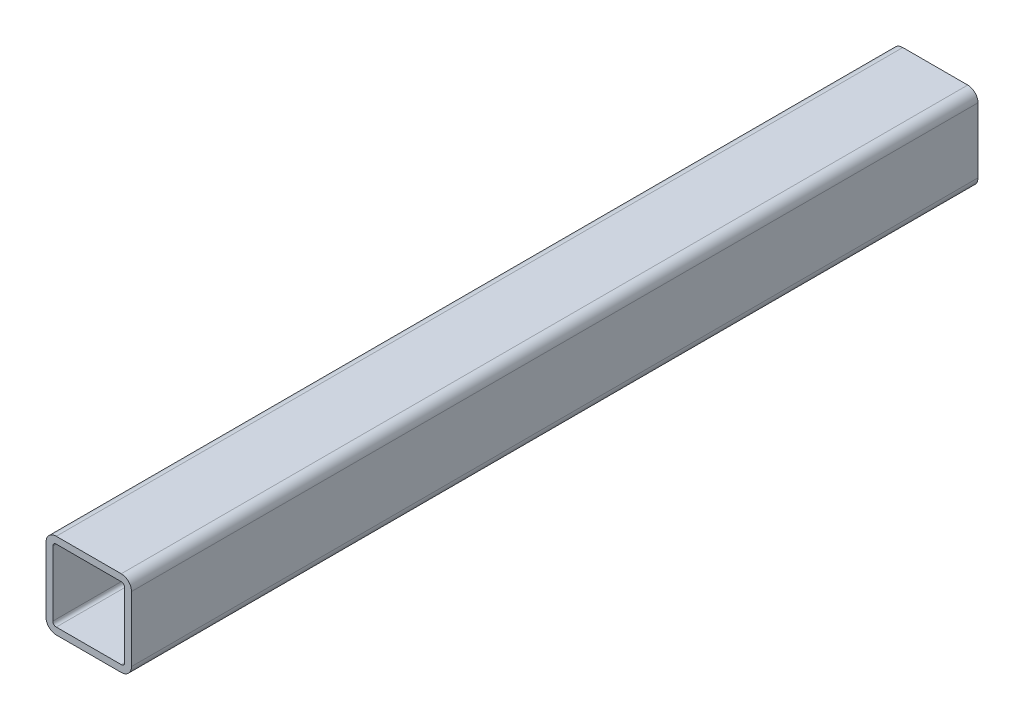
ISO-10303-21;
HEADER;
FILE_DESCRIPTION(('STEP AP214'),'2;1');
FILE_NAME('part.step','',(''),(''),'','','');
FILE_SCHEMA(('AUTOMOTIVE_DESIGN { 1 0 10303 214 1 1 1 1 }'));
ENDSEC;
DATA;
#1=APPLICATION_CONTEXT('core data for automotive mechanical design processes');
#2=APPLICATION_PROTOCOL_DEFINITION('international standard','automotive_design',2000,#1);
#3=PRODUCT_CONTEXT('',#1,'mechanical');
#4=PRODUCT('Part','Part','',(#3));
#5=PRODUCT_RELATED_PRODUCT_CATEGORY('part','',(#4));
#6=PRODUCT_DEFINITION_FORMATION('','',#4);
#7=PRODUCT_DEFINITION_CONTEXT('part definition',#1,'design');
#8=PRODUCT_DEFINITION('design','',#6,#7);
#9=PRODUCT_DEFINITION_SHAPE('','',#8);
#10=(LENGTH_UNIT() NAMED_UNIT(*) SI_UNIT(.MILLI.,.METRE.));
#11=(NAMED_UNIT(*) PLANE_ANGLE_UNIT() SI_UNIT($,.RADIAN.));
#12=(NAMED_UNIT(*) SI_UNIT($,.STERADIAN.) SOLID_ANGLE_UNIT());
#13=UNCERTAINTY_MEASURE_WITH_UNIT(LENGTH_MEASURE(1.E-05),#10,'distance_accuracy_value','');
#14=(GEOMETRIC_REPRESENTATION_CONTEXT(3) GLOBAL_UNCERTAINTY_ASSIGNED_CONTEXT((#13)) GLOBAL_UNIT_ASSIGNED_CONTEXT((#10,
#11,#12)) REPRESENTATION_CONTEXT('',''));
#15=CARTESIAN_POINT('',(0.,0.,0.));
#16=DIRECTION('',(0.,0.,1.));
#17=DIRECTION('',(1.,0.,0.));
#18=AXIS2_PLACEMENT_3D('',#15,#16,#17);
#19=CARTESIAN_POINT('',(0.,0.,247.5));
#20=DIRECTION('',(0.,0.,1.));
#21=DIRECTION('',(1.,0.,0.));
#22=AXIS2_PLACEMENT_3D('',#19,#20,#21);
#23=PLANE('',#22);
#24=DIRECTION('',(0.,1.,0.));
#25=VECTOR('',#24,1.);
#26=CARTESIAN_POINT('',(-12.5,-4.75,247.5));
#27=LINE('',#26,#25);
#28=CARTESIAN_POINT('',(-12.5,-9.5,247.5));
#29=VERTEX_POINT('',#28);
#30=CARTESIAN_POINT('',(-12.5,9.5,247.5));
#31=VERTEX_POINT('',#30);
#32=EDGE_CURVE('E215',#29,#31,#27,.T.);
#33=ORIENTED_EDGE('',*,*,#32,.F.);
#34=CARTESIAN_POINT('',(-9.5,-9.5,247.5));
#35=DIRECTION('',(0.,0.,-1.));
#36=DIRECTION('',(1.,0.,0.));
#37=AXIS2_PLACEMENT_3D('',#34,#35,#36);
#38=CIRCLE('',#37,3.);
#39=CARTESIAN_POINT('',(-9.5,-12.5,247.5));
#40=VERTEX_POINT('',#39);
#41=EDGE_CURVE('E221',#40,#29,#38,.T.);
#42=ORIENTED_EDGE('',*,*,#41,.F.);
#43=DIRECTION('',(-1.,0.,0.));
#44=VECTOR('',#43,1.);
#45=CARTESIAN_POINT('',(4.75,-12.5,247.5));
#46=LINE('',#45,#44);
#47=CARTESIAN_POINT('',(9.5,-12.5,247.5));
#48=VERTEX_POINT('',#47);
#49=EDGE_CURVE('E296',#48,#40,#46,.T.);
#50=ORIENTED_EDGE('',*,*,#49,.F.);
#51=CARTESIAN_POINT('',(9.5,-9.5,247.5));
#52=DIRECTION('',(0.,0.,-1.));
#53=DIRECTION('',(0.,1.,0.));
#54=AXIS2_PLACEMENT_3D('',#51,#52,#53);
#55=CIRCLE('',#54,3.);
#56=CARTESIAN_POINT('',(12.5,-9.5,247.5));
#57=VERTEX_POINT('',#56);
#58=EDGE_CURVE('E88',#57,#48,#55,.T.);
#59=ORIENTED_EDGE('',*,*,#58,.F.);
#60=DIRECTION('',(0.,-1.,0.));
#61=VECTOR('',#60,1.);
#62=CARTESIAN_POINT('',(12.5,4.75,247.5));
#63=LINE('',#62,#61);
#64=CARTESIAN_POINT('',(12.5,9.5,247.5));
#65=VERTEX_POINT('',#64);
#66=EDGE_CURVE('E170',#65,#57,#63,.T.);
#67=ORIENTED_EDGE('',*,*,#66,.F.);
#68=CARTESIAN_POINT('',(9.5,9.5,247.5));
#69=DIRECTION('',(0.,0.,-1.));
#70=DIRECTION('',(-1.,0.,0.));
#71=AXIS2_PLACEMENT_3D('',#68,#69,#70);
#72=CIRCLE('',#71,3.);
#73=CARTESIAN_POINT('',(9.5,12.5,247.5));
#74=VERTEX_POINT('',#73);
#75=EDGE_CURVE('E27',#74,#65,#72,.T.);
#76=ORIENTED_EDGE('',*,*,#75,.F.);
#77=DIRECTION('',(1.,0.,0.));
#78=VECTOR('',#77,1.);
#79=CARTESIAN_POINT('',(-4.75,12.5,247.5));
#80=LINE('',#79,#78);
#81=CARTESIAN_POINT('',(-9.5,12.5,247.5));
#82=VERTEX_POINT('',#81);
#83=EDGE_CURVE('E148',#82,#74,#80,.T.);
#84=ORIENTED_EDGE('',*,*,#83,.F.);
#85=CARTESIAN_POINT('',(-9.5,9.5,247.5));
#86=DIRECTION('',(0.,0.,-1.));
#87=DIRECTION('',(0.,-1.,0.));
#88=AXIS2_PLACEMENT_3D('',#85,#86,#87);
#89=CIRCLE('',#88,3.);
#90=EDGE_CURVE('E151',#31,#82,#89,.T.);
#91=ORIENTED_EDGE('',*,*,#90,.F.);
#92=EDGE_LOOP('',(#33,#42,#50,#59,#67,#76,#84,#91));
#93=FACE_BOUND('',#92,.T.);
#94=DIRECTION('',(-1.,0.,0.));
#95=VECTOR('',#94,1.);
#96=CARTESIAN_POINT('',(-4.75,10.5,247.5));
#97=LINE('',#96,#95);
#98=CARTESIAN_POINT('',(9.5,10.5,247.5));
#99=VERTEX_POINT('',#98);
#100=CARTESIAN_POINT('',(-9.5,10.5,247.5));
#101=VERTEX_POINT('',#100);
#102=EDGE_CURVE('E268',#99,#101,#97,.T.);
#103=ORIENTED_EDGE('',*,*,#102,.F.);
#104=CARTESIAN_POINT('',(9.5,9.5,247.5));
#105=DIRECTION('',(0.,0.,1.));
#106=DIRECTION('',(-1.,0.,0.));
#107=AXIS2_PLACEMENT_3D('',#104,#105,#106);
#108=CIRCLE('',#107,1.);
#109=CARTESIAN_POINT('',(10.5,9.5,247.5));
#110=VERTEX_POINT('',#109);
#111=EDGE_CURVE('E169',#110,#99,#108,.T.);
#112=ORIENTED_EDGE('',*,*,#111,.F.);
#113=DIRECTION('',(0.,1.,0.));
#114=VECTOR('',#113,1.);
#115=CARTESIAN_POINT('',(10.5,4.75,247.5));
#116=LINE('',#115,#114);
#117=CARTESIAN_POINT('',(10.5,-9.5,247.5));
#118=VERTEX_POINT('',#117);
#119=EDGE_CURVE('E250',#118,#110,#116,.T.);
#120=ORIENTED_EDGE('',*,*,#119,.F.);
#121=CARTESIAN_POINT('',(9.5,-9.5,247.5));
#122=DIRECTION('',(0.,0.,1.));
#123=DIRECTION('',(0.,1.,0.));
#124=AXIS2_PLACEMENT_3D('',#121,#122,#123);
#125=CIRCLE('',#124,1.);
#126=CARTESIAN_POINT('',(9.5,-10.5,247.5));
#127=VERTEX_POINT('',#126);
#128=EDGE_CURVE('E227',#127,#118,#125,.T.);
#129=ORIENTED_EDGE('',*,*,#128,.F.);
#130=DIRECTION('',(1.,0.,0.));
#131=VECTOR('',#130,1.);
#132=CARTESIAN_POINT('',(4.75,-10.5,247.5));
#133=LINE('',#132,#131);
#134=CARTESIAN_POINT('',(-9.5,-10.5,247.5));
#135=VERTEX_POINT('',#134);
#136=EDGE_CURVE('E281',#135,#127,#133,.T.);
#137=ORIENTED_EDGE('',*,*,#136,.F.);
#138=CARTESIAN_POINT('',(-9.5,-9.5,247.5));
#139=DIRECTION('',(0.,0.,1.));
#140=DIRECTION('',(1.,0.,0.));
#141=AXIS2_PLACEMENT_3D('',#138,#139,#140);
#142=CIRCLE('',#141,1.);
#143=CARTESIAN_POINT('',(-10.5,-9.5,247.5));
#144=VERTEX_POINT('',#143);
#145=EDGE_CURVE('E217',#144,#135,#142,.T.);
#146=ORIENTED_EDGE('',*,*,#145,.F.);
#147=DIRECTION('',(0.,-1.,0.));
#148=VECTOR('',#147,1.);
#149=CARTESIAN_POINT('',(-10.5,-4.75,247.5));
#150=LINE('',#149,#148);
#151=CARTESIAN_POINT('',(-10.5,9.5,247.5));
#152=VERTEX_POINT('',#151);
#153=EDGE_CURVE('E200',#152,#144,#150,.T.);
#154=ORIENTED_EDGE('',*,*,#153,.F.);
#155=CARTESIAN_POINT('',(-9.5,9.5,247.5));
#156=DIRECTION('',(0.,0.,1.));
#157=DIRECTION('',(0.,-1.,0.));
#158=AXIS2_PLACEMENT_3D('',#155,#156,#157);
#159=CIRCLE('',#158,1.);
#160=EDGE_CURVE('E216',#101,#152,#159,.T.);
#161=ORIENTED_EDGE('',*,*,#160,.F.);
#162=EDGE_LOOP('',(#103,#112,#120,#129,#137,#146,#154,#161));
#163=FACE_BOUND('',#162,.T.);
#164=ADVANCED_FACE('F16',(#93,#163),#23,.T.);
#165=CARTESIAN_POINT('',(0.,0.,0.));
#166=DIRECTION('',(0.,0.,1.));
#167=DIRECTION('',(1.,0.,0.));
#168=AXIS2_PLACEMENT_3D('',#165,#166,#167);
#169=PLANE('',#168);
#170=DIRECTION('',(0.,1.,0.));
#171=VECTOR('',#170,1.);
#172=CARTESIAN_POINT('',(-12.5,-4.75,0.));
#173=LINE('',#172,#171);
#174=CARTESIAN_POINT('',(-12.5,-9.5,0.));
#175=VERTEX_POINT('',#174);
#176=CARTESIAN_POINT('',(-12.5,9.5,0.));
#177=VERTEX_POINT('',#176);
#178=EDGE_CURVE('E143',#175,#177,#173,.T.);
#179=ORIENTED_EDGE('',*,*,#178,.T.);
#180=CARTESIAN_POINT('',(-9.5,9.5,0.));
#181=DIRECTION('',(0.,0.,-1.));
#182=DIRECTION('',(0.,-1.,0.));
#183=AXIS2_PLACEMENT_3D('',#180,#181,#182);
#184=CIRCLE('',#183,3.);
#185=CARTESIAN_POINT('',(-9.5,12.5,0.));
#186=VERTEX_POINT('',#185);
#187=EDGE_CURVE('E138',#177,#186,#184,.T.);
#188=ORIENTED_EDGE('',*,*,#187,.T.);
#189=DIRECTION('',(1.,0.,0.));
#190=VECTOR('',#189,1.);
#191=CARTESIAN_POINT('',(-4.75,12.5,0.));
#192=LINE('',#191,#190);
#193=CARTESIAN_POINT('',(9.5,12.5,0.));
#194=VERTEX_POINT('',#193);
#195=EDGE_CURVE('E126',#186,#194,#192,.T.);
#196=ORIENTED_EDGE('',*,*,#195,.T.);
#197=CARTESIAN_POINT('',(9.5,9.5,0.));
#198=DIRECTION('',(0.,0.,-1.));
#199=DIRECTION('',(-1.,0.,0.));
#200=AXIS2_PLACEMENT_3D('',#197,#198,#199);
#201=CIRCLE('',#200,3.);
#202=CARTESIAN_POINT('',(12.5,9.5,0.));
#203=VERTEX_POINT('',#202);
#204=EDGE_CURVE('E11',#194,#203,#201,.T.);
#205=ORIENTED_EDGE('',*,*,#204,.T.);
#206=DIRECTION('',(0.,-1.,0.));
#207=VECTOR('',#206,1.);
#208=CARTESIAN_POINT('',(12.5,4.75,0.));
#209=LINE('',#208,#207);
#210=CARTESIAN_POINT('',(12.5,-9.5,0.));
#211=VERTEX_POINT('',#210);
#212=EDGE_CURVE('E180',#203,#211,#209,.T.);
#213=ORIENTED_EDGE('',*,*,#212,.T.);
#214=CARTESIAN_POINT('',(9.5,-9.5,0.));
#215=DIRECTION('',(0.,0.,-1.));
#216=DIRECTION('',(0.,1.,0.));
#217=AXIS2_PLACEMENT_3D('',#214,#215,#216);
#218=CIRCLE('',#217,3.);
#219=CARTESIAN_POINT('',(9.5,-12.5,0.));
#220=VERTEX_POINT('',#219);
#221=EDGE_CURVE('E190',#211,#220,#218,.T.);
#222=ORIENTED_EDGE('',*,*,#221,.T.);
#223=DIRECTION('',(-1.,0.,0.));
#224=VECTOR('',#223,1.);
#225=CARTESIAN_POINT('',(4.75,-12.5,0.));
#226=LINE('',#225,#224);
#227=CARTESIAN_POINT('',(-9.5,-12.5,0.));
#228=VERTEX_POINT('',#227);
#229=EDGE_CURVE('E226',#220,#228,#226,.T.);
#230=ORIENTED_EDGE('',*,*,#229,.T.);
#231=CARTESIAN_POINT('',(-9.5,-9.5,0.));
#232=DIRECTION('',(0.,0.,-1.));
#233=DIRECTION('',(1.,0.,0.));
#234=AXIS2_PLACEMENT_3D('',#231,#232,#233);
#235=CIRCLE('',#234,3.);
#236=EDGE_CURVE('E235',#228,#175,#235,.T.);
#237=ORIENTED_EDGE('',*,*,#236,.T.);
#238=EDGE_LOOP('',(#179,#188,#196,#205,#213,#222,#230,#237));
#239=FACE_BOUND('',#238,.T.);
#240=DIRECTION('',(-1.,0.,0.));
#241=VECTOR('',#240,1.);
#242=CARTESIAN_POINT('',(-4.75,10.5,0.));
#243=LINE('',#242,#241);
#244=CARTESIAN_POINT('',(9.5,10.5,0.));
#245=VERTEX_POINT('',#244);
#246=CARTESIAN_POINT('',(-9.5,10.5,0.));
#247=VERTEX_POINT('',#246);
#248=EDGE_CURVE('E109',#245,#247,#243,.T.);
#249=ORIENTED_EDGE('',*,*,#248,.T.);
#250=CARTESIAN_POINT('',(-9.5,9.5,0.));
#251=DIRECTION('',(0.,0.,1.));
#252=DIRECTION('',(0.,-1.,0.));
#253=AXIS2_PLACEMENT_3D('',#250,#251,#252);
#254=CIRCLE('',#253,1.);
#255=CARTESIAN_POINT('',(-10.5,9.5,0.));
#256=VERTEX_POINT('',#255);
#257=EDGE_CURVE('E211',#247,#256,#254,.T.);
#258=ORIENTED_EDGE('',*,*,#257,.T.);
#259=DIRECTION('',(0.,-1.,0.));
#260=VECTOR('',#259,1.);
#261=CARTESIAN_POINT('',(-10.5,-4.75,0.));
#262=LINE('',#261,#260);
#263=CARTESIAN_POINT('',(-10.5,-9.5,0.));
#264=VERTEX_POINT('',#263);
#265=EDGE_CURVE('E240',#256,#264,#262,.T.);
#266=ORIENTED_EDGE('',*,*,#265,.T.);
#267=CARTESIAN_POINT('',(-9.5,-9.5,0.));
#268=DIRECTION('',(0.,0.,1.));
#269=DIRECTION('',(1.,0.,0.));
#270=AXIS2_PLACEMENT_3D('',#267,#268,#269);
#271=CIRCLE('',#270,1.);
#272=CARTESIAN_POINT('',(-9.5,-10.5,0.));
#273=VERTEX_POINT('',#272);
#274=EDGE_CURVE('E201',#264,#273,#271,.T.);
#275=ORIENTED_EDGE('',*,*,#274,.T.);
#276=DIRECTION('',(1.,0.,0.));
#277=VECTOR('',#276,1.);
#278=CARTESIAN_POINT('',(4.75,-10.5,0.));
#279=LINE('',#278,#277);
#280=CARTESIAN_POINT('',(9.5,-10.5,0.));
#281=VERTEX_POINT('',#280);
#282=EDGE_CURVE('E202',#273,#281,#279,.T.);
#283=ORIENTED_EDGE('',*,*,#282,.T.);
#284=CARTESIAN_POINT('',(9.5,-9.5,0.));
#285=DIRECTION('',(0.,0.,1.));
#286=DIRECTION('',(0.,1.,0.));
#287=AXIS2_PLACEMENT_3D('',#284,#285,#286);
#288=CIRCLE('',#287,1.);
#289=CARTESIAN_POINT('',(10.5,-9.5,0.));
#290=VERTEX_POINT('',#289);
#291=EDGE_CURVE('E254',#281,#290,#288,.T.);
#292=ORIENTED_EDGE('',*,*,#291,.T.);
#293=DIRECTION('',(0.,1.,0.));
#294=VECTOR('',#293,1.);
#295=CARTESIAN_POINT('',(10.5,4.75,0.));
#296=LINE('',#295,#294);
#297=CARTESIAN_POINT('',(10.5,9.5,0.));
#298=VERTEX_POINT('',#297);
#299=EDGE_CURVE('E249',#290,#298,#296,.T.);
#300=ORIENTED_EDGE('',*,*,#299,.T.);
#301=CARTESIAN_POINT('',(9.5,9.5,0.));
#302=DIRECTION('',(0.,0.,1.));
#303=DIRECTION('',(-1.,0.,0.));
#304=AXIS2_PLACEMENT_3D('',#301,#302,#303);
#305=CIRCLE('',#304,1.);
#306=EDGE_CURVE('E168',#298,#245,#305,.T.);
#307=ORIENTED_EDGE('',*,*,#306,.T.);
#308=EDGE_LOOP('',(#249,#258,#266,#275,#283,#292,#300,#307));
#309=FACE_BOUND('',#308,.T.);
#310=ADVANCED_FACE('F139',(#239,#309),#169,.F.);
#311=CARTESIAN_POINT('',(9.5,9.5,0.));
#312=DIRECTION('',(0.,0.,1.));
#313=DIRECTION('',(-1.,0.,0.));
#314=AXIS2_PLACEMENT_3D('',#311,#312,#313);
#315=CYLINDRICAL_SURFACE('',#314,3.);
#316=ORIENTED_EDGE('',*,*,#75,.T.);
#317=DIRECTION('',(0.,0.,1.));
#318=VECTOR('',#317,1.);
#319=CARTESIAN_POINT('',(12.5,9.5,0.));
#320=LINE('',#319,#318);
#321=EDGE_CURVE('E210',#203,#65,#320,.T.);
#322=ORIENTED_EDGE('',*,*,#321,.F.);
#323=ORIENTED_EDGE('',*,*,#204,.F.);
#324=DIRECTION('',(0.,0.,1.));
#325=VECTOR('',#324,1.);
#326=CARTESIAN_POINT('',(9.5,12.5,0.));
#327=LINE('',#326,#325);
#328=EDGE_CURVE('E132',#194,#74,#327,.T.);
#329=ORIENTED_EDGE('',*,*,#328,.T.);
#330=EDGE_LOOP('',(#316,#322,#323,#329));
#331=FACE_BOUND('',#330,.T.);
#332=ADVANCED_FACE('F318',(#331),#315,.T.);
#333=CARTESIAN_POINT('',(-9.5,12.5,0.));
#334=DIRECTION('',(0.,1.,0.));
#335=DIRECTION('',(1.,0.,0.));
#336=AXIS2_PLACEMENT_3D('',#333,#334,#335);
#337=PLANE('',#336);
#338=ORIENTED_EDGE('',*,*,#83,.T.);
#339=ORIENTED_EDGE('',*,*,#328,.F.);
#340=ORIENTED_EDGE('',*,*,#195,.F.);
#341=DIRECTION('',(0.,0.,1.));
#342=VECTOR('',#341,1.);
#343=CARTESIAN_POINT('',(-9.5,12.5,0.));
#344=LINE('',#343,#342);
#345=EDGE_CURVE('E20',#186,#82,#344,.T.);
#346=ORIENTED_EDGE('',*,*,#345,.T.);
#347=EDGE_LOOP('',(#338,#339,#340,#346));
#348=FACE_BOUND('',#347,.T.);
#349=ADVANCED_FACE('F129',(#348),#337,.T.);
#350=CARTESIAN_POINT('',(-9.5,9.5,0.));
#351=DIRECTION('',(0.,0.,1.));
#352=DIRECTION('',(0.,-1.,0.));
#353=AXIS2_PLACEMENT_3D('',#350,#351,#352);
#354=CYLINDRICAL_SURFACE('',#353,3.);
#355=ORIENTED_EDGE('',*,*,#90,.T.);
#356=ORIENTED_EDGE('',*,*,#345,.F.);
#357=ORIENTED_EDGE('',*,*,#187,.F.);
#358=DIRECTION('',(0.,0.,1.));
#359=VECTOR('',#358,1.);
#360=CARTESIAN_POINT('',(-12.5,9.5,0.));
#361=LINE('',#360,#359);
#362=EDGE_CURVE('E161',#177,#31,#361,.T.);
#363=ORIENTED_EDGE('',*,*,#362,.T.);
#364=EDGE_LOOP('',(#355,#356,#357,#363));
#365=FACE_BOUND('',#364,.T.);
#366=ADVANCED_FACE('F150',(#365),#354,.T.);
#367=CARTESIAN_POINT('',(-12.5,-9.5,0.));
#368=DIRECTION('',(-1.,0.,0.));
#369=DIRECTION('',(0.,1.,0.));
#370=AXIS2_PLACEMENT_3D('',#367,#368,#369);
#371=PLANE('',#370);
#372=ORIENTED_EDGE('',*,*,#32,.T.);
#373=ORIENTED_EDGE('',*,*,#362,.F.);
#374=ORIENTED_EDGE('',*,*,#178,.F.);
#375=DIRECTION('',(0.,0.,1.));
#376=VECTOR('',#375,1.);
#377=CARTESIAN_POINT('',(-12.5,-9.5,0.));
#378=LINE('',#377,#376);
#379=EDGE_CURVE('E225',#175,#29,#378,.T.);
#380=ORIENTED_EDGE('',*,*,#379,.T.);
#381=EDGE_LOOP('',(#372,#373,#374,#380));
#382=FACE_BOUND('',#381,.T.);
#383=ADVANCED_FACE('F436',(#382),#371,.T.);
#384=CARTESIAN_POINT('',(-9.5,9.5,0.));
#385=DIRECTION('',(0.,0.,1.));
#386=DIRECTION('',(0.,-1.,0.));
#387=AXIS2_PLACEMENT_3D('',#384,#385,#386);
#388=CYLINDRICAL_SURFACE('',#387,1.);
#389=ORIENTED_EDGE('',*,*,#160,.T.);
#390=DIRECTION('',(0.,0.,1.));
#391=VECTOR('',#390,1.);
#392=CARTESIAN_POINT('',(-10.5,9.5,0.));
#393=LINE('',#392,#391);
#394=EDGE_CURVE('E244',#256,#152,#393,.T.);
#395=ORIENTED_EDGE('',*,*,#394,.F.);
#396=ORIENTED_EDGE('',*,*,#257,.F.);
#397=DIRECTION('',(0.,0.,1.));
#398=VECTOR('',#397,1.);
#399=CARTESIAN_POINT('',(-9.5,10.5,0.));
#400=LINE('',#399,#398);
#401=EDGE_CURVE('E292',#247,#101,#400,.T.);
#402=ORIENTED_EDGE('',*,*,#401,.T.);
#403=EDGE_LOOP('',(#389,#395,#396,#402));
#404=FACE_BOUND('',#403,.T.);
#405=ADVANCED_FACE('F400',(#404),#388,.F.);
#406=CARTESIAN_POINT('',(-10.5,-9.5,0.));
#407=DIRECTION('',(-1.,0.,0.));
#408=DIRECTION('',(0.,0.,1.));
#409=AXIS2_PLACEMENT_3D('',#406,#407,#408);
#410=PLANE('',#409);
#411=ORIENTED_EDGE('',*,*,#153,.T.);
#412=DIRECTION('',(0.,0.,1.));
#413=VECTOR('',#412,1.);
#414=CARTESIAN_POINT('',(-10.5,-9.5,0.));
#415=LINE('',#414,#413);
#416=EDGE_CURVE('E196',#264,#144,#415,.T.);
#417=ORIENTED_EDGE('',*,*,#416,.F.);
#418=ORIENTED_EDGE('',*,*,#265,.F.);
#419=ORIENTED_EDGE('',*,*,#394,.T.);
#420=EDGE_LOOP('',(#411,#417,#418,#419));
#421=FACE_BOUND('',#420,.T.);
#422=ADVANCED_FACE('F391',(#421),#410,.F.);
#423=CARTESIAN_POINT('',(-9.5,-9.5,0.));
#424=DIRECTION('',(0.,0.,1.));
#425=DIRECTION('',(1.,0.,0.));
#426=AXIS2_PLACEMENT_3D('',#423,#424,#425);
#427=CYLINDRICAL_SURFACE('',#426,1.);
#428=ORIENTED_EDGE('',*,*,#145,.T.);
#429=DIRECTION('',(0.,0.,1.));
#430=VECTOR('',#429,1.);
#431=CARTESIAN_POINT('',(-9.5,-10.5,0.));
#432=LINE('',#431,#430);
#433=EDGE_CURVE('E206',#273,#135,#432,.T.);
#434=ORIENTED_EDGE('',*,*,#433,.F.);
#435=ORIENTED_EDGE('',*,*,#274,.F.);
#436=ORIENTED_EDGE('',*,*,#416,.T.);
#437=EDGE_LOOP('',(#428,#434,#435,#436));
#438=FACE_BOUND('',#437,.T.);
#439=ADVANCED_FACE('F18',(#438),#427,.F.);
#440=CARTESIAN_POINT('',(-9.5,10.5,0.));
#441=DIRECTION('',(0.,1.,0.));
#442=DIRECTION('',(1.,0.,0.));
#443=AXIS2_PLACEMENT_3D('',#440,#441,#442);
#444=PLANE('',#443);
#445=ORIENTED_EDGE('',*,*,#102,.T.);
#446=ORIENTED_EDGE('',*,*,#401,.F.);
#447=ORIENTED_EDGE('',*,*,#248,.F.);
#448=DIRECTION('',(0.,0.,1.));
#449=VECTOR('',#448,1.);
#450=CARTESIAN_POINT('',(9.5,10.5,0.));
#451=LINE('',#450,#449);
#452=EDGE_CURVE('E166',#245,#99,#451,.T.);
#453=ORIENTED_EDGE('',*,*,#452,.T.);
#454=EDGE_LOOP('',(#445,#446,#447,#453));
#455=FACE_BOUND('',#454,.T.);
#456=ADVANCED_FACE('F334',(#455),#444,.F.);
#457=CARTESIAN_POINT('',(-9.5,-9.5,0.));
#458=DIRECTION('',(0.,0.,1.));
#459=DIRECTION('',(1.,0.,0.));
#460=AXIS2_PLACEMENT_3D('',#457,#458,#459);
#461=CYLINDRICAL_SURFACE('',#460,3.);
#462=ORIENTED_EDGE('',*,*,#41,.T.);
#463=ORIENTED_EDGE('',*,*,#379,.F.);
#464=ORIENTED_EDGE('',*,*,#236,.F.);
#465=DIRECTION('',(0.,0.,1.));
#466=VECTOR('',#465,1.);
#467=CARTESIAN_POINT('',(-9.5,-12.5,0.));
#468=LINE('',#467,#466);
#469=EDGE_CURVE('E288',#228,#40,#468,.T.);
#470=ORIENTED_EDGE('',*,*,#469,.T.);
#471=EDGE_LOOP('',(#462,#463,#464,#470));
#472=FACE_BOUND('',#471,.T.);
#473=ADVANCED_FACE('F421',(#472),#461,.T.);
#474=CARTESIAN_POINT('',(9.5,-12.5,0.));
#475=DIRECTION('',(0.,-1.,0.));
#476=DIRECTION('',(0.,0.,-1.));
#477=AXIS2_PLACEMENT_3D('',#474,#475,#476);
#478=PLANE('',#477);
#479=ORIENTED_EDGE('',*,*,#49,.T.);
#480=ORIENTED_EDGE('',*,*,#469,.F.);
#481=ORIENTED_EDGE('',*,*,#229,.F.);
#482=DIRECTION('',(0.,0.,1.));
#483=VECTOR('',#482,1.);
#484=CARTESIAN_POINT('',(9.5,-12.5,0.));
#485=LINE('',#484,#483);
#486=EDGE_CURVE('E192',#220,#48,#485,.T.);
#487=ORIENTED_EDGE('',*,*,#486,.T.);
#488=EDGE_LOOP('',(#479,#480,#481,#487));
#489=FACE_BOUND('',#488,.T.);
#490=ADVANCED_FACE('F426',(#489),#478,.T.);
#491=CARTESIAN_POINT('',(9.5,-9.5,0.));
#492=DIRECTION('',(0.,0.,1.));
#493=DIRECTION('',(0.,1.,0.));
#494=AXIS2_PLACEMENT_3D('',#491,#492,#493);
#495=CYLINDRICAL_SURFACE('',#494,3.);
#496=ORIENTED_EDGE('',*,*,#58,.T.);
#497=ORIENTED_EDGE('',*,*,#486,.F.);
#498=ORIENTED_EDGE('',*,*,#221,.F.);
#499=DIRECTION('',(0.,0.,1.));
#500=VECTOR('',#499,1.);
#501=CARTESIAN_POINT('',(12.5,-9.5,0.));
#502=LINE('',#501,#500);
#503=EDGE_CURVE('E173',#211,#57,#502,.T.);
#504=ORIENTED_EDGE('',*,*,#503,.T.);
#505=EDGE_LOOP('',(#496,#497,#498,#504));
#506=FACE_BOUND('',#505,.T.);
#507=ADVANCED_FACE('F442',(#506),#495,.T.);
#508=CARTESIAN_POINT('',(12.5,9.5,0.));
#509=DIRECTION('',(1.,0.,0.));
#510=DIRECTION('',(0.,1.,0.));
#511=AXIS2_PLACEMENT_3D('',#508,#509,#510);
#512=PLANE('',#511);
#513=ORIENTED_EDGE('',*,*,#66,.T.);
#514=ORIENTED_EDGE('',*,*,#503,.F.);
#515=ORIENTED_EDGE('',*,*,#212,.F.);
#516=ORIENTED_EDGE('',*,*,#321,.T.);
#517=EDGE_LOOP('',(#513,#514,#515,#516));
#518=FACE_BOUND('',#517,.T.);
#519=ADVANCED_FACE('F439',(#518),#512,.T.);
#520=CARTESIAN_POINT('',(9.5,9.5,0.));
#521=DIRECTION('',(0.,0.,1.));
#522=DIRECTION('',(-1.,0.,0.));
#523=AXIS2_PLACEMENT_3D('',#520,#521,#522);
#524=CYLINDRICAL_SURFACE('',#523,1.);
#525=ORIENTED_EDGE('',*,*,#111,.T.);
#526=ORIENTED_EDGE('',*,*,#452,.F.);
#527=ORIENTED_EDGE('',*,*,#306,.F.);
#528=DIRECTION('',(0.,0.,1.));
#529=VECTOR('',#528,1.);
#530=CARTESIAN_POINT('',(10.5,9.5,0.));
#531=LINE('',#530,#529);
#532=EDGE_CURVE('E245',#298,#110,#531,.T.);
#533=ORIENTED_EDGE('',*,*,#532,.T.);
#534=EDGE_LOOP('',(#525,#526,#527,#533));
#535=FACE_BOUND('',#534,.T.);
#536=ADVANCED_FACE('F347',(#535),#524,.F.);
#537=CARTESIAN_POINT('',(10.5,9.5,0.));
#538=DIRECTION('',(1.,0.,0.));
#539=DIRECTION('',(0.,-1.,0.));
#540=AXIS2_PLACEMENT_3D('',#537,#538,#539);
#541=PLANE('',#540);
#542=ORIENTED_EDGE('',*,*,#119,.T.);
#543=ORIENTED_EDGE('',*,*,#532,.F.);
#544=ORIENTED_EDGE('',*,*,#299,.F.);
#545=DIRECTION('',(0.,0.,1.));
#546=VECTOR('',#545,1.);
#547=CARTESIAN_POINT('',(10.5,-9.5,0.));
#548=LINE('',#547,#546);
#549=EDGE_CURVE('E231',#290,#118,#548,.T.);
#550=ORIENTED_EDGE('',*,*,#549,.T.);
#551=EDGE_LOOP('',(#542,#543,#544,#550));
#552=FACE_BOUND('',#551,.T.);
#553=ADVANCED_FACE('F339',(#552),#541,.F.);
#554=CARTESIAN_POINT('',(9.5,-9.5,0.));
#555=DIRECTION('',(0.,0.,1.));
#556=DIRECTION('',(0.,1.,0.));
#557=AXIS2_PLACEMENT_3D('',#554,#555,#556);
#558=CYLINDRICAL_SURFACE('',#557,1.);
#559=ORIENTED_EDGE('',*,*,#128,.T.);
#560=ORIENTED_EDGE('',*,*,#549,.F.);
#561=ORIENTED_EDGE('',*,*,#291,.F.);
#562=DIRECTION('',(0.,0.,1.));
#563=VECTOR('',#562,1.);
#564=CARTESIAN_POINT('',(9.5,-10.5,0.));
#565=LINE('',#564,#563);
#566=EDGE_CURVE('E165',#281,#127,#565,.T.);
#567=ORIENTED_EDGE('',*,*,#566,.T.);
#568=EDGE_LOOP('',(#559,#560,#561,#567));
#569=FACE_BOUND('',#568,.T.);
#570=ADVANCED_FACE('F336',(#569),#558,.F.);
#571=CARTESIAN_POINT('',(9.5,-10.5,0.));
#572=DIRECTION('',(0.,-1.,0.));
#573=DIRECTION('',(0.,0.,-1.));
#574=AXIS2_PLACEMENT_3D('',#571,#572,#573);
#575=PLANE('',#574);
#576=ORIENTED_EDGE('',*,*,#136,.T.);
#577=ORIENTED_EDGE('',*,*,#566,.F.);
#578=ORIENTED_EDGE('',*,*,#282,.F.);
#579=ORIENTED_EDGE('',*,*,#433,.T.);
#580=EDGE_LOOP('',(#576,#577,#578,#579));
#581=FACE_BOUND('',#580,.T.);
#582=ADVANCED_FACE('F338',(#581),#575,.F.);
#583=CLOSED_SHELL('',(#164,#310,#332,#349,#366,#383,#405,#422,#439,#456,#473,#490,#507,#519,
#536,#553,#570,#582));
#584=MANIFOLD_SOLID_BREP('B1',#583);
#585=ADVANCED_BREP_SHAPE_REPRESENTATION('',(#18,#584),#14);
#586=SHAPE_DEFINITION_REPRESENTATION(#9,#585);
ENDSEC;
END-ISO-10303-21;
